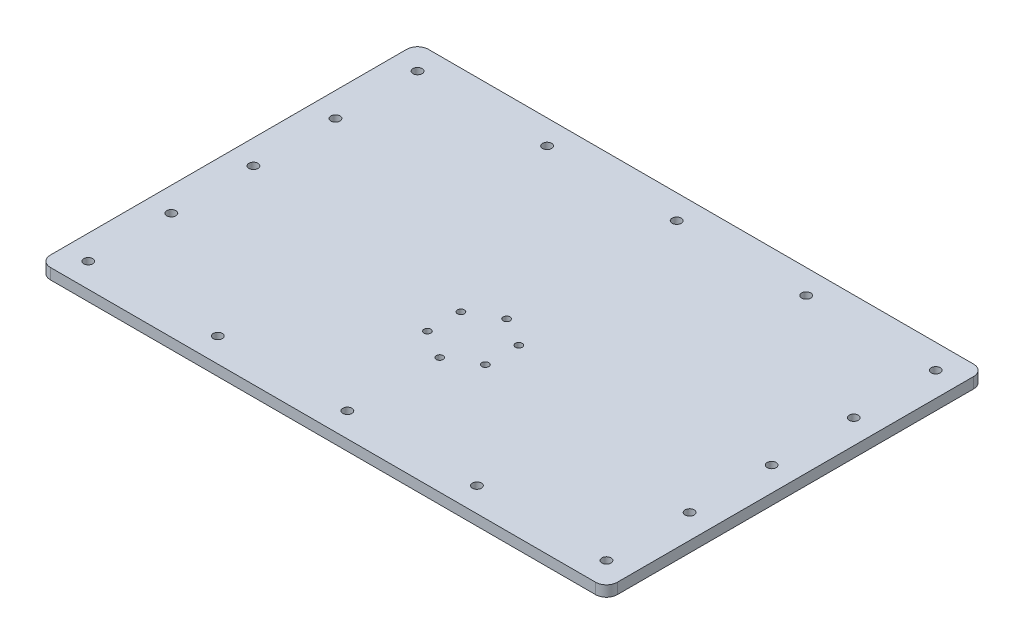
ISO-10303-21;
HEADER;
FILE_DESCRIPTION(('STEP AP214'),'2;1');
FILE_NAME('part.step','',(''),(''),'','','');
FILE_SCHEMA(('AUTOMOTIVE_DESIGN { 1 0 10303 214 1 1 1 1 }'));
ENDSEC;
DATA;
#1=APPLICATION_CONTEXT('core data for automotive mechanical design processes');
#2=APPLICATION_PROTOCOL_DEFINITION('international standard','automotive_design',2000,#1);
#3=PRODUCT_CONTEXT('',#1,'mechanical');
#4=PRODUCT('Part','Part','',(#3));
#5=PRODUCT_RELATED_PRODUCT_CATEGORY('part','',(#4));
#6=PRODUCT_DEFINITION_FORMATION('','',#4);
#7=PRODUCT_DEFINITION_CONTEXT('part definition',#1,'design');
#8=PRODUCT_DEFINITION('design','',#6,#7);
#9=PRODUCT_DEFINITION_SHAPE('','',#8);
#10=(LENGTH_UNIT() NAMED_UNIT(*) SI_UNIT(.MILLI.,.METRE.));
#11=(NAMED_UNIT(*) PLANE_ANGLE_UNIT() SI_UNIT($,.RADIAN.));
#12=(NAMED_UNIT(*) SI_UNIT($,.STERADIAN.) SOLID_ANGLE_UNIT());
#13=UNCERTAINTY_MEASURE_WITH_UNIT(LENGTH_MEASURE(1.E-05),#10,'distance_accuracy_value','');
#14=(GEOMETRIC_REPRESENTATION_CONTEXT(3) GLOBAL_UNCERTAINTY_ASSIGNED_CONTEXT((#13)) GLOBAL_UNIT_ASSIGNED_CONTEXT((#10,
#11,#12)) REPRESENTATION_CONTEXT('',''));
#15=CARTESIAN_POINT('',(0.,0.,0.));
#16=DIRECTION('',(0.,0.,1.));
#17=DIRECTION('',(1.,0.,0.));
#18=AXIS2_PLACEMENT_3D('',#15,#16,#17);
#19=CARTESIAN_POINT('',(-252.5,10.,165.));
#20=DIRECTION('',(0.,-1.,0.));
#21=DIRECTION('',(0.,0.,-1.));
#22=AXIS2_PLACEMENT_3D('',#19,#20,#21);
#23=PLANE('',#22);
#24=CARTESIAN_POINT('',(-252.5,10.,165.));
#25=DIRECTION('',(0.,1.,0.));
#26=DIRECTION('',(0.,0.,-1.));
#27=AXIS2_PLACEMENT_3D('',#24,#25,#26);
#28=CIRCLE('',#27,10.);
#29=CARTESIAN_POINT('',(-262.5,10.,165.));
#30=VERTEX_POINT('',#29);
#31=CARTESIAN_POINT('',(-252.5,10.,175.));
#32=VERTEX_POINT('',#31);
#33=EDGE_CURVE('E154',#30,#32,#28,.T.);
#34=ORIENTED_EDGE('',*,*,#33,.T.);
#35=DIRECTION('',(1.,0.,0.));
#36=VECTOR('',#35,1.);
#37=CARTESIAN_POINT('',(-252.5,10.,175.));
#38=LINE('',#37,#36);
#39=CARTESIAN_POINT('',(252.5,10.,175.));
#40=VERTEX_POINT('',#39);
#41=EDGE_CURVE('E102',#32,#40,#38,.T.);
#42=ORIENTED_EDGE('',*,*,#41,.T.);
#43=CARTESIAN_POINT('',(252.5,10.,165.));
#44=DIRECTION('',(0.,1.,0.));
#45=DIRECTION('',(0.,0.,1.));
#46=AXIS2_PLACEMENT_3D('',#43,#44,#45);
#47=CIRCLE('',#46,10.);
#48=CARTESIAN_POINT('',(262.5,10.,165.));
#49=VERTEX_POINT('',#48);
#50=EDGE_CURVE('E169',#40,#49,#47,.T.);
#51=ORIENTED_EDGE('',*,*,#50,.T.);
#52=DIRECTION('',(0.,0.,-1.));
#53=VECTOR('',#52,1.);
#54=CARTESIAN_POINT('',(262.5,10.,-165.));
#55=LINE('',#54,#53);
#56=CARTESIAN_POINT('',(262.5,10.,-165.));
#57=VERTEX_POINT('',#56);
#58=EDGE_CURVE('E182',#49,#57,#55,.T.);
#59=ORIENTED_EDGE('',*,*,#58,.T.);
#60=CARTESIAN_POINT('',(252.5,10.,-165.));
#61=DIRECTION('',(0.,1.,0.));
#62=DIRECTION('',(0.,0.,1.));
#63=AXIS2_PLACEMENT_3D('',#60,#61,#62);
#64=CIRCLE('',#63,10.);
#65=CARTESIAN_POINT('',(252.5,10.,-175.));
#66=VERTEX_POINT('',#65);
#67=EDGE_CURVE('E121',#57,#66,#64,.T.);
#68=ORIENTED_EDGE('',*,*,#67,.T.);
#69=DIRECTION('',(-1.,0.,0.));
#70=VECTOR('',#69,1.);
#71=CARTESIAN_POINT('',(-252.5,10.,-175.));
#72=LINE('',#71,#70);
#73=CARTESIAN_POINT('',(-252.5,10.,-175.));
#74=VERTEX_POINT('',#73);
#75=EDGE_CURVE('E115',#66,#74,#72,.T.);
#76=ORIENTED_EDGE('',*,*,#75,.T.);
#77=CARTESIAN_POINT('',(-252.5,10.,-165.));
#78=DIRECTION('',(0.,1.,0.));
#79=DIRECTION('',(0.,0.,-1.));
#80=AXIS2_PLACEMENT_3D('',#77,#78,#79);
#81=CIRCLE('',#80,10.);
#82=CARTESIAN_POINT('',(-262.5,10.,-165.));
#83=VERTEX_POINT('',#82);
#84=EDGE_CURVE('E119',#74,#83,#81,.T.);
#85=ORIENTED_EDGE('',*,*,#84,.T.);
#86=DIRECTION('',(0.,0.,1.));
#87=VECTOR('',#86,1.);
#88=CARTESIAN_POINT('',(-262.5,10.,-165.));
#89=LINE('',#88,#87);
#90=EDGE_CURVE('E59',#83,#30,#89,.T.);
#91=ORIENTED_EDGE('',*,*,#90,.T.);
#92=EDGE_LOOP('',(#34,#42,#51,#59,#68,#76,#85,#91));
#93=FACE_BOUND('',#92,.T.);
#94=CARTESIAN_POINT('',(-240.,10.,-152.5));
#95=DIRECTION('',(0.,1.,0.));
#96=DIRECTION('',(0.,0.,1.));
#97=AXIS2_PLACEMENT_3D('',#94,#95,#96);
#98=CIRCLE('',#97,4.20000000000004);
#99=CARTESIAN_POINT('',(-240.,10.,-148.3));
#100=VERTEX_POINT('',#99);
#101=EDGE_CURVE('E143',#100,#100,#98,.T.);
#102=ORIENTED_EDGE('',*,*,#101,.F.);
#103=EDGE_LOOP('',(#102));
#104=FACE_BOUND('',#103,.T.);
#105=CARTESIAN_POINT('',(240.,10.,-152.5));
#106=DIRECTION('',(0.,1.,0.));
#107=DIRECTION('',(0.,0.,1.));
#108=AXIS2_PLACEMENT_3D('',#105,#106,#107);
#109=CIRCLE('',#108,4.19999999999998);
#110=CARTESIAN_POINT('',(240.,10.,-148.3));
#111=VERTEX_POINT('',#110);
#112=EDGE_CURVE('E191',#111,#111,#109,.T.);
#113=ORIENTED_EDGE('',*,*,#112,.F.);
#114=EDGE_LOOP('',(#113));
#115=FACE_BOUND('',#114,.T.);
#116=CARTESIAN_POINT('',(-240.,10.,-76.4999999999999));
#117=DIRECTION('',(0.,1.,0.));
#118=DIRECTION('',(0.,0.,1.));
#119=AXIS2_PLACEMENT_3D('',#116,#117,#118);
#120=CIRCLE('',#119,4.20000000000004);
#121=CARTESIAN_POINT('',(-240.,10.,-72.2999999999999));
#122=VERTEX_POINT('',#121);
#123=EDGE_CURVE('E197',#122,#122,#120,.T.);
#124=ORIENTED_EDGE('',*,*,#123,.F.);
#125=EDGE_LOOP('',(#124));
#126=FACE_BOUND('',#125,.T.);
#127=CARTESIAN_POINT('',(-240.,10.,-0.499999999999945));
#128=DIRECTION('',(0.,1.,0.));
#129=DIRECTION('',(0.,0.,1.));
#130=AXIS2_PLACEMENT_3D('',#127,#128,#129);
#131=CIRCLE('',#130,4.19999999999998);
#132=CARTESIAN_POINT('',(-240.,10.,3.70000000000003));
#133=VERTEX_POINT('',#132);
#134=EDGE_CURVE('E203',#133,#133,#131,.T.);
#135=ORIENTED_EDGE('',*,*,#134,.F.);
#136=EDGE_LOOP('',(#135));
#137=FACE_BOUND('',#136,.T.);
#138=CARTESIAN_POINT('',(-240.,10.,75.5));
#139=DIRECTION('',(0.,1.,0.));
#140=DIRECTION('',(0.,0.,1.));
#141=AXIS2_PLACEMENT_3D('',#138,#139,#140);
#142=CIRCLE('',#141,4.20000000000004);
#143=CARTESIAN_POINT('',(-240.,10.,79.7000000000001));
#144=VERTEX_POINT('',#143);
#145=EDGE_CURVE('E209',#144,#144,#142,.T.);
#146=ORIENTED_EDGE('',*,*,#145,.F.);
#147=EDGE_LOOP('',(#146));
#148=FACE_BOUND('',#147,.T.);
#149=CARTESIAN_POINT('',(-240.,10.,152.5));
#150=DIRECTION('',(0.,1.,0.));
#151=DIRECTION('',(0.,0.,1.));
#152=AXIS2_PLACEMENT_3D('',#149,#150,#151);
#153=CIRCLE('',#152,4.19999999999998);
#154=CARTESIAN_POINT('',(-240.,10.,156.7));
#155=VERTEX_POINT('',#154);
#156=EDGE_CURVE('E215',#155,#155,#153,.T.);
#157=ORIENTED_EDGE('',*,*,#156,.F.);
#158=EDGE_LOOP('',(#157));
#159=FACE_BOUND('',#158,.T.);
#160=CARTESIAN_POINT('',(240.,10.,-76.4999999999999));
#161=DIRECTION('',(0.,1.,0.));
#162=DIRECTION('',(0.,0.,1.));
#163=AXIS2_PLACEMENT_3D('',#160,#161,#162);
#164=CIRCLE('',#163,4.19999999999998);
#165=CARTESIAN_POINT('',(240.,10.,-72.3));
#166=VERTEX_POINT('',#165);
#167=EDGE_CURVE('E221',#166,#166,#164,.T.);
#168=ORIENTED_EDGE('',*,*,#167,.F.);
#169=EDGE_LOOP('',(#168));
#170=FACE_BOUND('',#169,.T.);
#171=CARTESIAN_POINT('',(240.,10.,-0.499999999999945));
#172=DIRECTION('',(0.,1.,0.));
#173=DIRECTION('',(0.,0.,1.));
#174=AXIS2_PLACEMENT_3D('',#171,#172,#173);
#175=CIRCLE('',#174,4.19999999999992);
#176=CARTESIAN_POINT('',(240.,10.,3.69999999999998));
#177=VERTEX_POINT('',#176);
#178=EDGE_CURVE('E227',#177,#177,#175,.T.);
#179=ORIENTED_EDGE('',*,*,#178,.F.);
#180=EDGE_LOOP('',(#179));
#181=FACE_BOUND('',#180,.T.);
#182=CARTESIAN_POINT('',(240.,10.,75.5));
#183=DIRECTION('',(0.,1.,0.));
#184=DIRECTION('',(0.,0.,1.));
#185=AXIS2_PLACEMENT_3D('',#182,#183,#184);
#186=CIRCLE('',#185,4.20000000000004);
#187=CARTESIAN_POINT('',(240.,10.,79.7000000000001));
#188=VERTEX_POINT('',#187);
#189=EDGE_CURVE('E233',#188,#188,#186,.T.);
#190=ORIENTED_EDGE('',*,*,#189,.F.);
#191=EDGE_LOOP('',(#190));
#192=FACE_BOUND('',#191,.T.);
#193=CARTESIAN_POINT('',(-120.,10.,152.5));
#194=DIRECTION('',(0.,1.,0.));
#195=DIRECTION('',(0.,0.,1.));
#196=AXIS2_PLACEMENT_3D('',#193,#194,#195);
#197=CIRCLE('',#196,4.19999999999998);
#198=CARTESIAN_POINT('',(-120.,10.,156.7));
#199=VERTEX_POINT('',#198);
#200=EDGE_CURVE('E239',#199,#199,#197,.T.);
#201=ORIENTED_EDGE('',*,*,#200,.F.);
#202=EDGE_LOOP('',(#201));
#203=FACE_BOUND('',#202,.T.);
#204=CARTESIAN_POINT('',(-120.,10.,-152.5));
#205=DIRECTION('',(0.,1.,0.));
#206=DIRECTION('',(0.,0.,1.));
#207=AXIS2_PLACEMENT_3D('',#204,#205,#206);
#208=CIRCLE('',#207,4.20000000000004);
#209=CARTESIAN_POINT('',(-120.,10.,-148.3));
#210=VERTEX_POINT('',#209);
#211=EDGE_CURVE('E245',#210,#210,#208,.T.);
#212=ORIENTED_EDGE('',*,*,#211,.F.);
#213=EDGE_LOOP('',(#212));
#214=FACE_BOUND('',#213,.T.);
#215=CARTESIAN_POINT('',(0.,10.,5.));
#216=DIRECTION('',(0.,1.,0.));
#217=DIRECTION('',(0.,0.,1.));
#218=AXIS2_PLACEMENT_3D('',#215,#216,#217);
#219=CIRCLE('',#218,3.2);
#220=CARTESIAN_POINT('',(0.,10.,8.20000000000001));
#221=VERTEX_POINT('',#220);
#222=EDGE_CURVE('E251',#221,#221,#219,.T.);
#223=ORIENTED_EDGE('',*,*,#222,.F.);
#224=EDGE_LOOP('',(#223));
#225=FACE_BOUND('',#224,.T.);
#226=CARTESIAN_POINT('',(0.,10.,-152.5));
#227=DIRECTION('',(0.,1.,0.));
#228=DIRECTION('',(0.,0.,1.));
#229=AXIS2_PLACEMENT_3D('',#226,#227,#228);
#230=CIRCLE('',#229,4.20000000000001);
#231=CARTESIAN_POINT('',(0.,10.,-148.3));
#232=VERTEX_POINT('',#231);
#233=EDGE_CURVE('E257',#232,#232,#230,.T.);
#234=ORIENTED_EDGE('',*,*,#233,.F.);
#235=EDGE_LOOP('',(#234));
#236=FACE_BOUND('',#235,.T.);
#237=CARTESIAN_POINT('',(0.,10.,152.5));
#238=DIRECTION('',(0.,1.,0.));
#239=DIRECTION('',(0.,0.,1.));
#240=AXIS2_PLACEMENT_3D('',#237,#238,#239);
#241=CIRCLE('',#240,4.19999999999997);
#242=CARTESIAN_POINT('',(0.,10.,156.7));
#243=VERTEX_POINT('',#242);
#244=EDGE_CURVE('E263',#243,#243,#241,.T.);
#245=ORIENTED_EDGE('',*,*,#244,.F.);
#246=EDGE_LOOP('',(#245));
#247=FACE_BOUND('',#246,.T.);
#248=CARTESIAN_POINT('',(26.8467875173183,10.,20.4999999999989));
#249=DIRECTION('',(0.,1.,0.));
#250=DIRECTION('',(0.,0.,1.));
#251=AXIS2_PLACEMENT_3D('',#248,#249,#250);
#252=CIRCLE('',#251,3.2);
#253=CARTESIAN_POINT('',(26.8467875173183,10.,23.6999999999989));
#254=VERTEX_POINT('',#253);
#255=EDGE_CURVE('E269',#254,#254,#252,.T.);
#256=ORIENTED_EDGE('',*,*,#255,.F.);
#257=EDGE_LOOP('',(#256));
#258=FACE_BOUND('',#257,.T.);
#259=CARTESIAN_POINT('',(26.8467875173195,10.,51.499999999999));
#260=DIRECTION('',(0.,1.,0.));
#261=DIRECTION('',(0.,0.,1.));
#262=AXIS2_PLACEMENT_3D('',#259,#260,#261);
#263=CIRCLE('',#262,3.2);
#264=CARTESIAN_POINT('',(26.8467875173195,10.,54.699999999999));
#265=VERTEX_POINT('',#264);
#266=EDGE_CURVE('E275',#265,#265,#263,.T.);
#267=ORIENTED_EDGE('',*,*,#266,.F.);
#268=EDGE_LOOP('',(#267));
#269=FACE_BOUND('',#268,.T.);
#270=CARTESIAN_POINT('',(2.41156151370987E-12,10.,67.));
#271=DIRECTION('',(0.,1.,0.));
#272=DIRECTION('',(0.,0.,1.));
#273=AXIS2_PLACEMENT_3D('',#270,#271,#272);
#274=CIRCLE('',#273,3.2);
#275=CARTESIAN_POINT('',(2.41156151370987E-12,10.,70.2));
#276=VERTEX_POINT('',#275);
#277=EDGE_CURVE('E281',#276,#276,#274,.T.);
#278=ORIENTED_EDGE('',*,*,#277,.F.);
#279=EDGE_LOOP('',(#278));
#280=FACE_BOUND('',#279,.T.);
#281=CARTESIAN_POINT('',(-26.8467875173158,10.,51.5000000000009));
#282=DIRECTION('',(0.,1.,0.));
#283=DIRECTION('',(0.,0.,1.));
#284=AXIS2_PLACEMENT_3D('',#281,#282,#283);
#285=CIRCLE('',#284,3.2);
#286=CARTESIAN_POINT('',(-26.8467875173158,10.,54.7000000000009));
#287=VERTEX_POINT('',#286);
#288=EDGE_CURVE('E287',#287,#287,#285,.T.);
#289=ORIENTED_EDGE('',*,*,#288,.F.);
#290=EDGE_LOOP('',(#289));
#291=FACE_BOUND('',#290,.T.);
#292=CARTESIAN_POINT('',(120.,10.,-152.5));
#293=DIRECTION('',(0.,1.,0.));
#294=DIRECTION('',(0.,0.,1.));
#295=AXIS2_PLACEMENT_3D('',#292,#293,#294);
#296=CIRCLE('',#295,4.20000000000001);
#297=CARTESIAN_POINT('',(120.,10.,-148.3));
#298=VERTEX_POINT('',#297);
#299=EDGE_CURVE('E293',#298,#298,#296,.T.);
#300=ORIENTED_EDGE('',*,*,#299,.F.);
#301=EDGE_LOOP('',(#300));
#302=FACE_BOUND('',#301,.T.);
#303=CARTESIAN_POINT('',(-26.8467875173168,10.,20.5000000000008));
#304=DIRECTION('',(0.,1.,0.));
#305=DIRECTION('',(0.,0.,1.));
#306=AXIS2_PLACEMENT_3D('',#303,#304,#305);
#307=CIRCLE('',#306,3.2);
#308=CARTESIAN_POINT('',(-26.8467875173168,10.,23.7000000000008));
#309=VERTEX_POINT('',#308);
#310=EDGE_CURVE('E299',#309,#309,#307,.T.);
#311=ORIENTED_EDGE('',*,*,#310,.F.);
#312=EDGE_LOOP('',(#311));
#313=FACE_BOUND('',#312,.T.);
#314=CARTESIAN_POINT('',(120.,10.,152.5));
#315=DIRECTION('',(0.,1.,0.));
#316=DIRECTION('',(0.,0.,1.));
#317=AXIS2_PLACEMENT_3D('',#314,#315,#316);
#318=CIRCLE('',#317,4.19999999999998);
#319=CARTESIAN_POINT('',(120.,10.,156.7));
#320=VERTEX_POINT('',#319);
#321=EDGE_CURVE('E305',#320,#320,#318,.T.);
#322=ORIENTED_EDGE('',*,*,#321,.F.);
#323=EDGE_LOOP('',(#322));
#324=FACE_BOUND('',#323,.T.);
#325=CARTESIAN_POINT('',(240.,10.,152.5));
#326=DIRECTION('',(0.,1.,0.));
#327=DIRECTION('',(0.,0.,1.));
#328=AXIS2_PLACEMENT_3D('',#325,#326,#327);
#329=CIRCLE('',#328,4.19999999999998);
#330=CARTESIAN_POINT('',(240.,10.,156.7));
#331=VERTEX_POINT('',#330);
#332=EDGE_CURVE('E311',#331,#331,#329,.T.);
#333=ORIENTED_EDGE('',*,*,#332,.F.);
#334=EDGE_LOOP('',(#333));
#335=FACE_BOUND('',#334,.T.);
#336=ADVANCED_FACE('F42',(#93,#104,#115,#126,#137,#148,#159,#170,#181,#192,#203,#214,#225,#236,
#247,#258,#269,#280,#291,#302,#313,#324,#335),#23,.F.);
#337=CARTESIAN_POINT('',(-252.5,0.,165.));
#338=DIRECTION('',(0.,-1.,0.));
#339=DIRECTION('',(0.,0.,-1.));
#340=AXIS2_PLACEMENT_3D('',#337,#338,#339);
#341=PLANE('',#340);
#342=CARTESIAN_POINT('',(120.,0.,152.5));
#343=DIRECTION('',(0.,1.,0.));
#344=DIRECTION('',(0.,0.,1.));
#345=AXIS2_PLACEMENT_3D('',#342,#343,#344);
#346=CIRCLE('',#345,4.19999999999998);
#347=CARTESIAN_POINT('',(120.,0.,156.7));
#348=VERTEX_POINT('',#347);
#349=EDGE_CURVE('E308',#348,#348,#346,.T.);
#350=ORIENTED_EDGE('',*,*,#349,.T.);
#351=EDGE_LOOP('',(#350));
#352=FACE_BOUND('',#351,.T.);
#353=CARTESIAN_POINT('',(120.,0.,-152.5));
#354=DIRECTION('',(0.,1.,0.));
#355=DIRECTION('',(0.,0.,1.));
#356=AXIS2_PLACEMENT_3D('',#353,#354,#355);
#357=CIRCLE('',#356,4.20000000000001);
#358=CARTESIAN_POINT('',(120.,0.,-148.3));
#359=VERTEX_POINT('',#358);
#360=EDGE_CURVE('E296',#359,#359,#357,.T.);
#361=ORIENTED_EDGE('',*,*,#360,.T.);
#362=EDGE_LOOP('',(#361));
#363=FACE_BOUND('',#362,.T.);
#364=CARTESIAN_POINT('',(2.41156151370987E-12,0.,67.));
#365=DIRECTION('',(0.,1.,0.));
#366=DIRECTION('',(0.,0.,1.));
#367=AXIS2_PLACEMENT_3D('',#364,#365,#366);
#368=CIRCLE('',#367,3.2);
#369=CARTESIAN_POINT('',(2.41156151370987E-12,0.,70.2));
#370=VERTEX_POINT('',#369);
#371=EDGE_CURVE('E284',#370,#370,#368,.T.);
#372=ORIENTED_EDGE('',*,*,#371,.T.);
#373=EDGE_LOOP('',(#372));
#374=FACE_BOUND('',#373,.T.);
#375=CARTESIAN_POINT('',(26.8467875173183,0.,20.4999999999989));
#376=DIRECTION('',(0.,1.,0.));
#377=DIRECTION('',(0.,0.,1.));
#378=AXIS2_PLACEMENT_3D('',#375,#376,#377);
#379=CIRCLE('',#378,3.2);
#380=CARTESIAN_POINT('',(26.8467875173183,0.,23.6999999999989));
#381=VERTEX_POINT('',#380);
#382=EDGE_CURVE('E272',#381,#381,#379,.T.);
#383=ORIENTED_EDGE('',*,*,#382,.T.);
#384=EDGE_LOOP('',(#383));
#385=FACE_BOUND('',#384,.T.);
#386=CARTESIAN_POINT('',(0.,0.,-152.5));
#387=DIRECTION('',(0.,1.,0.));
#388=DIRECTION('',(0.,0.,1.));
#389=AXIS2_PLACEMENT_3D('',#386,#387,#388);
#390=CIRCLE('',#389,4.20000000000001);
#391=CARTESIAN_POINT('',(0.,0.,-148.3));
#392=VERTEX_POINT('',#391);
#393=EDGE_CURVE('E260',#392,#392,#390,.T.);
#394=ORIENTED_EDGE('',*,*,#393,.T.);
#395=EDGE_LOOP('',(#394));
#396=FACE_BOUND('',#395,.T.);
#397=CARTESIAN_POINT('',(-120.,0.,-152.5));
#398=DIRECTION('',(0.,1.,0.));
#399=DIRECTION('',(0.,0.,1.));
#400=AXIS2_PLACEMENT_3D('',#397,#398,#399);
#401=CIRCLE('',#400,4.20000000000004);
#402=CARTESIAN_POINT('',(-120.,0.,-148.3));
#403=VERTEX_POINT('',#402);
#404=EDGE_CURVE('E248',#403,#403,#401,.T.);
#405=ORIENTED_EDGE('',*,*,#404,.T.);
#406=EDGE_LOOP('',(#405));
#407=FACE_BOUND('',#406,.T.);
#408=CARTESIAN_POINT('',(240.,0.,75.5));
#409=DIRECTION('',(0.,1.,0.));
#410=DIRECTION('',(0.,0.,1.));
#411=AXIS2_PLACEMENT_3D('',#408,#409,#410);
#412=CIRCLE('',#411,4.20000000000004);
#413=CARTESIAN_POINT('',(240.,0.,79.7000000000001));
#414=VERTEX_POINT('',#413);
#415=EDGE_CURVE('E236',#414,#414,#412,.T.);
#416=ORIENTED_EDGE('',*,*,#415,.T.);
#417=EDGE_LOOP('',(#416));
#418=FACE_BOUND('',#417,.T.);
#419=CARTESIAN_POINT('',(240.,0.,-76.4999999999999));
#420=DIRECTION('',(0.,1.,0.));
#421=DIRECTION('',(0.,0.,1.));
#422=AXIS2_PLACEMENT_3D('',#419,#420,#421);
#423=CIRCLE('',#422,4.19999999999998);
#424=CARTESIAN_POINT('',(240.,0.,-72.3));
#425=VERTEX_POINT('',#424);
#426=EDGE_CURVE('E224',#425,#425,#423,.T.);
#427=ORIENTED_EDGE('',*,*,#426,.T.);
#428=EDGE_LOOP('',(#427));
#429=FACE_BOUND('',#428,.T.);
#430=CARTESIAN_POINT('',(-240.,0.,75.5));
#431=DIRECTION('',(0.,1.,0.));
#432=DIRECTION('',(0.,0.,1.));
#433=AXIS2_PLACEMENT_3D('',#430,#431,#432);
#434=CIRCLE('',#433,4.20000000000004);
#435=CARTESIAN_POINT('',(-240.,0.,79.7000000000001));
#436=VERTEX_POINT('',#435);
#437=EDGE_CURVE('E212',#436,#436,#434,.T.);
#438=ORIENTED_EDGE('',*,*,#437,.T.);
#439=EDGE_LOOP('',(#438));
#440=FACE_BOUND('',#439,.T.);
#441=CARTESIAN_POINT('',(-240.,0.,-76.4999999999999));
#442=DIRECTION('',(0.,1.,0.));
#443=DIRECTION('',(0.,0.,1.));
#444=AXIS2_PLACEMENT_3D('',#441,#442,#443);
#445=CIRCLE('',#444,4.20000000000004);
#446=CARTESIAN_POINT('',(-240.,0.,-72.2999999999999));
#447=VERTEX_POINT('',#446);
#448=EDGE_CURVE('E200',#447,#447,#445,.T.);
#449=ORIENTED_EDGE('',*,*,#448,.T.);
#450=EDGE_LOOP('',(#449));
#451=FACE_BOUND('',#450,.T.);
#452=CARTESIAN_POINT('',(-240.,0.,-152.5));
#453=DIRECTION('',(0.,1.,0.));
#454=DIRECTION('',(0.,0.,1.));
#455=AXIS2_PLACEMENT_3D('',#452,#453,#454);
#456=CIRCLE('',#455,4.20000000000004);
#457=CARTESIAN_POINT('',(-240.,0.,-148.3));
#458=VERTEX_POINT('',#457);
#459=EDGE_CURVE('E188',#458,#458,#456,.T.);
#460=ORIENTED_EDGE('',*,*,#459,.T.);
#461=EDGE_LOOP('',(#460));
#462=FACE_BOUND('',#461,.T.);
#463=CARTESIAN_POINT('',(-252.5,0.,165.));
#464=DIRECTION('',(0.,1.,0.));
#465=DIRECTION('',(0.,0.,-1.));
#466=AXIS2_PLACEMENT_3D('',#463,#464,#465);
#467=CIRCLE('',#466,10.);
#468=CARTESIAN_POINT('',(-262.5,0.,165.));
#469=VERTEX_POINT('',#468);
#470=CARTESIAN_POINT('',(-252.5,0.,175.));
#471=VERTEX_POINT('',#470);
#472=EDGE_CURVE('E139',#469,#471,#467,.T.);
#473=ORIENTED_EDGE('',*,*,#472,.F.);
#474=DIRECTION('',(0.,0.,1.));
#475=VECTOR('',#474,1.);
#476=CARTESIAN_POINT('',(-262.5,0.,-165.));
#477=LINE('',#476,#475);
#478=CARTESIAN_POINT('',(-262.5,0.,-165.));
#479=VERTEX_POINT('',#478);
#480=EDGE_CURVE('E94',#479,#469,#477,.T.);
#481=ORIENTED_EDGE('',*,*,#480,.F.);
#482=CARTESIAN_POINT('',(-252.5,0.,-165.));
#483=DIRECTION('',(0.,1.,0.));
#484=DIRECTION('',(0.,0.,-1.));
#485=AXIS2_PLACEMENT_3D('',#482,#483,#484);
#486=CIRCLE('',#485,10.);
#487=CARTESIAN_POINT('',(-252.5,0.,-175.));
#488=VERTEX_POINT('',#487);
#489=EDGE_CURVE('E88',#488,#479,#486,.T.);
#490=ORIENTED_EDGE('',*,*,#489,.F.);
#491=DIRECTION('',(-1.,0.,0.));
#492=VECTOR('',#491,1.);
#493=CARTESIAN_POINT('',(-252.5,0.,-175.));
#494=LINE('',#493,#492);
#495=CARTESIAN_POINT('',(252.5,0.,-175.));
#496=VERTEX_POINT('',#495);
#497=EDGE_CURVE('E129',#496,#488,#494,.T.);
#498=ORIENTED_EDGE('',*,*,#497,.F.);
#499=CARTESIAN_POINT('',(252.5,0.,-165.));
#500=DIRECTION('',(0.,1.,0.));
#501=DIRECTION('',(0.,0.,1.));
#502=AXIS2_PLACEMENT_3D('',#499,#500,#501);
#503=CIRCLE('',#502,10.);
#504=CARTESIAN_POINT('',(262.5,0.,-165.));
#505=VERTEX_POINT('',#504);
#506=EDGE_CURVE('E149',#505,#496,#503,.T.);
#507=ORIENTED_EDGE('',*,*,#506,.F.);
#508=DIRECTION('',(0.,0.,-1.));
#509=VECTOR('',#508,1.);
#510=CARTESIAN_POINT('',(262.5,0.,-165.));
#511=LINE('',#510,#509);
#512=CARTESIAN_POINT('',(262.5,0.,165.));
#513=VERTEX_POINT('',#512);
#514=EDGE_CURVE('E147',#513,#505,#511,.T.);
#515=ORIENTED_EDGE('',*,*,#514,.F.);
#516=CARTESIAN_POINT('',(252.5,0.,165.));
#517=DIRECTION('',(0.,1.,0.));
#518=DIRECTION('',(0.,0.,1.));
#519=AXIS2_PLACEMENT_3D('',#516,#517,#518);
#520=CIRCLE('',#519,10.);
#521=CARTESIAN_POINT('',(252.5,0.,175.));
#522=VERTEX_POINT('',#521);
#523=EDGE_CURVE('E145',#522,#513,#520,.T.);
#524=ORIENTED_EDGE('',*,*,#523,.F.);
#525=DIRECTION('',(1.,0.,0.));
#526=VECTOR('',#525,1.);
#527=CARTESIAN_POINT('',(-252.5,0.,175.));
#528=LINE('',#527,#526);
#529=EDGE_CURVE('E142',#471,#522,#528,.T.);
#530=ORIENTED_EDGE('',*,*,#529,.F.);
#531=EDGE_LOOP('',(#473,#481,#490,#498,#507,#515,#524,#530));
#532=FACE_BOUND('',#531,.T.);
#533=CARTESIAN_POINT('',(240.,0.,-152.5));
#534=DIRECTION('',(0.,1.,0.));
#535=DIRECTION('',(0.,0.,1.));
#536=AXIS2_PLACEMENT_3D('',#533,#534,#535);
#537=CIRCLE('',#536,4.19999999999998);
#538=CARTESIAN_POINT('',(240.,0.,-148.3));
#539=VERTEX_POINT('',#538);
#540=EDGE_CURVE('E194',#539,#539,#537,.T.);
#541=ORIENTED_EDGE('',*,*,#540,.T.);
#542=EDGE_LOOP('',(#541));
#543=FACE_BOUND('',#542,.T.);
#544=CARTESIAN_POINT('',(-240.,0.,-0.499999999999945));
#545=DIRECTION('',(0.,1.,0.));
#546=DIRECTION('',(0.,0.,1.));
#547=AXIS2_PLACEMENT_3D('',#544,#545,#546);
#548=CIRCLE('',#547,4.19999999999998);
#549=CARTESIAN_POINT('',(-240.,0.,3.70000000000003));
#550=VERTEX_POINT('',#549);
#551=EDGE_CURVE('E206',#550,#550,#548,.T.);
#552=ORIENTED_EDGE('',*,*,#551,.T.);
#553=EDGE_LOOP('',(#552));
#554=FACE_BOUND('',#553,.T.);
#555=CARTESIAN_POINT('',(-240.,0.,152.5));
#556=DIRECTION('',(0.,1.,0.));
#557=DIRECTION('',(0.,0.,1.));
#558=AXIS2_PLACEMENT_3D('',#555,#556,#557);
#559=CIRCLE('',#558,4.19999999999998);
#560=CARTESIAN_POINT('',(-240.,0.,156.7));
#561=VERTEX_POINT('',#560);
#562=EDGE_CURVE('E218',#561,#561,#559,.T.);
#563=ORIENTED_EDGE('',*,*,#562,.T.);
#564=EDGE_LOOP('',(#563));
#565=FACE_BOUND('',#564,.T.);
#566=CARTESIAN_POINT('',(240.,0.,-0.499999999999945));
#567=DIRECTION('',(0.,1.,0.));
#568=DIRECTION('',(0.,0.,1.));
#569=AXIS2_PLACEMENT_3D('',#566,#567,#568);
#570=CIRCLE('',#569,4.19999999999992);
#571=CARTESIAN_POINT('',(240.,0.,3.69999999999998));
#572=VERTEX_POINT('',#571);
#573=EDGE_CURVE('E230',#572,#572,#570,.T.);
#574=ORIENTED_EDGE('',*,*,#573,.T.);
#575=EDGE_LOOP('',(#574));
#576=FACE_BOUND('',#575,.T.);
#577=CARTESIAN_POINT('',(-120.,0.,152.5));
#578=DIRECTION('',(0.,1.,0.));
#579=DIRECTION('',(0.,0.,1.));
#580=AXIS2_PLACEMENT_3D('',#577,#578,#579);
#581=CIRCLE('',#580,4.19999999999998);
#582=CARTESIAN_POINT('',(-120.,0.,156.7));
#583=VERTEX_POINT('',#582);
#584=EDGE_CURVE('E242',#583,#583,#581,.T.);
#585=ORIENTED_EDGE('',*,*,#584,.T.);
#586=EDGE_LOOP('',(#585));
#587=FACE_BOUND('',#586,.T.);
#588=CARTESIAN_POINT('',(0.,0.,5.));
#589=DIRECTION('',(0.,1.,0.));
#590=DIRECTION('',(0.,0.,1.));
#591=AXIS2_PLACEMENT_3D('',#588,#589,#590);
#592=CIRCLE('',#591,3.2);
#593=CARTESIAN_POINT('',(0.,0.,8.20000000000001));
#594=VERTEX_POINT('',#593);
#595=EDGE_CURVE('E254',#594,#594,#592,.T.);
#596=ORIENTED_EDGE('',*,*,#595,.T.);
#597=EDGE_LOOP('',(#596));
#598=FACE_BOUND('',#597,.T.);
#599=CARTESIAN_POINT('',(0.,0.,152.5));
#600=DIRECTION('',(0.,1.,0.));
#601=DIRECTION('',(0.,0.,1.));
#602=AXIS2_PLACEMENT_3D('',#599,#600,#601);
#603=CIRCLE('',#602,4.19999999999997);
#604=CARTESIAN_POINT('',(0.,0.,156.7));
#605=VERTEX_POINT('',#604);
#606=EDGE_CURVE('E266',#605,#605,#603,.T.);
#607=ORIENTED_EDGE('',*,*,#606,.T.);
#608=EDGE_LOOP('',(#607));
#609=FACE_BOUND('',#608,.T.);
#610=CARTESIAN_POINT('',(26.8467875173195,0.,51.499999999999));
#611=DIRECTION('',(0.,1.,0.));
#612=DIRECTION('',(0.,0.,1.));
#613=AXIS2_PLACEMENT_3D('',#610,#611,#612);
#614=CIRCLE('',#613,3.2);
#615=CARTESIAN_POINT('',(26.8467875173195,0.,54.699999999999));
#616=VERTEX_POINT('',#615);
#617=EDGE_CURVE('E278',#616,#616,#614,.T.);
#618=ORIENTED_EDGE('',*,*,#617,.T.);
#619=EDGE_LOOP('',(#618));
#620=FACE_BOUND('',#619,.T.);
#621=CARTESIAN_POINT('',(-26.8467875173158,0.,51.5000000000009));
#622=DIRECTION('',(0.,1.,0.));
#623=DIRECTION('',(0.,0.,1.));
#624=AXIS2_PLACEMENT_3D('',#621,#622,#623);
#625=CIRCLE('',#624,3.2);
#626=CARTESIAN_POINT('',(-26.8467875173158,0.,54.7000000000009));
#627=VERTEX_POINT('',#626);
#628=EDGE_CURVE('E290',#627,#627,#625,.T.);
#629=ORIENTED_EDGE('',*,*,#628,.T.);
#630=EDGE_LOOP('',(#629));
#631=FACE_BOUND('',#630,.T.);
#632=CARTESIAN_POINT('',(-26.8467875173168,0.,20.5000000000008));
#633=DIRECTION('',(0.,1.,0.));
#634=DIRECTION('',(0.,0.,1.));
#635=AXIS2_PLACEMENT_3D('',#632,#633,#634);
#636=CIRCLE('',#635,3.2);
#637=CARTESIAN_POINT('',(-26.8467875173168,0.,23.7000000000008));
#638=VERTEX_POINT('',#637);
#639=EDGE_CURVE('E302',#638,#638,#636,.T.);
#640=ORIENTED_EDGE('',*,*,#639,.T.);
#641=EDGE_LOOP('',(#640));
#642=FACE_BOUND('',#641,.T.);
#643=CARTESIAN_POINT('',(240.,0.,152.5));
#644=DIRECTION('',(0.,1.,0.));
#645=DIRECTION('',(0.,0.,1.));
#646=AXIS2_PLACEMENT_3D('',#643,#644,#645);
#647=CIRCLE('',#646,4.19999999999998);
#648=CARTESIAN_POINT('',(240.,0.,156.7));
#649=VERTEX_POINT('',#648);
#650=EDGE_CURVE('E314',#649,#649,#647,.T.);
#651=ORIENTED_EDGE('',*,*,#650,.T.);
#652=EDGE_LOOP('',(#651));
#653=FACE_BOUND('',#652,.T.);
#654=ADVANCED_FACE('F173',(#352,#363,#374,#385,#396,#407,#418,#429,#440,#451,#462,#532,#543,
#554,#565,#576,#587,#598,#609,#620,#631,#642,#653),#341,.T.);
#655=CARTESIAN_POINT('',(-252.5,10.,165.));
#656=DIRECTION('',(0.,-1.,0.));
#657=DIRECTION('',(0.,0.,-1.));
#658=AXIS2_PLACEMENT_3D('',#655,#656,#657);
#659=CYLINDRICAL_SURFACE('',#658,10.);
#660=ORIENTED_EDGE('',*,*,#472,.T.);
#661=DIRECTION('',(0.,-1.,0.));
#662=VECTOR('',#661,1.);
#663=CARTESIAN_POINT('',(-252.5,10.,175.));
#664=LINE('',#663,#662);
#665=EDGE_CURVE('E11',#32,#471,#664,.T.);
#666=ORIENTED_EDGE('',*,*,#665,.F.);
#667=ORIENTED_EDGE('',*,*,#33,.F.);
#668=DIRECTION('',(0.,-1.,0.));
#669=VECTOR('',#668,1.);
#670=CARTESIAN_POINT('',(-262.5,10.,165.));
#671=LINE('',#670,#669);
#672=EDGE_CURVE('E135',#30,#469,#671,.T.);
#673=ORIENTED_EDGE('',*,*,#672,.T.);
#674=EDGE_LOOP('',(#660,#666,#667,#673));
#675=FACE_BOUND('',#674,.T.);
#676=ADVANCED_FACE('F44',(#675),#659,.T.);
#677=CARTESIAN_POINT('',(-252.5,10.,175.));
#678=DIRECTION('',(0.,0.,-1.));
#679=DIRECTION('',(-1.,0.,0.));
#680=AXIS2_PLACEMENT_3D('',#677,#678,#679);
#681=PLANE('',#680);
#682=ORIENTED_EDGE('',*,*,#529,.T.);
#683=DIRECTION('',(0.,-1.,0.));
#684=VECTOR('',#683,1.);
#685=CARTESIAN_POINT('',(252.5,10.,175.));
#686=LINE('',#685,#684);
#687=EDGE_CURVE('E51',#40,#522,#686,.T.);
#688=ORIENTED_EDGE('',*,*,#687,.F.);
#689=ORIENTED_EDGE('',*,*,#41,.F.);
#690=ORIENTED_EDGE('',*,*,#665,.T.);
#691=EDGE_LOOP('',(#682,#688,#689,#690));
#692=FACE_BOUND('',#691,.T.);
#693=ADVANCED_FACE('F346',(#692),#681,.F.);
#694=CARTESIAN_POINT('',(252.5,10.,165.));
#695=DIRECTION('',(0.,-1.,0.));
#696=DIRECTION('',(0.,0.,-1.));
#697=AXIS2_PLACEMENT_3D('',#694,#695,#696);
#698=CYLINDRICAL_SURFACE('',#697,10.);
#699=ORIENTED_EDGE('',*,*,#523,.T.);
#700=DIRECTION('',(0.,-1.,0.));
#701=VECTOR('',#700,1.);
#702=CARTESIAN_POINT('',(262.5,10.,165.));
#703=LINE('',#702,#701);
#704=EDGE_CURVE('E161',#49,#513,#703,.T.);
#705=ORIENTED_EDGE('',*,*,#704,.F.);
#706=ORIENTED_EDGE('',*,*,#50,.F.);
#707=ORIENTED_EDGE('',*,*,#687,.T.);
#708=EDGE_LOOP('',(#699,#705,#706,#707));
#709=FACE_BOUND('',#708,.T.);
#710=ADVANCED_FACE('F167',(#709),#698,.T.);
#711=CARTESIAN_POINT('',(262.5,10.,-165.));
#712=DIRECTION('',(-1.,0.,0.));
#713=DIRECTION('',(0.,0.,1.));
#714=AXIS2_PLACEMENT_3D('',#711,#712,#713);
#715=PLANE('',#714);
#716=ORIENTED_EDGE('',*,*,#514,.T.);
#717=DIRECTION('',(0.,-1.,0.));
#718=VECTOR('',#717,1.);
#719=CARTESIAN_POINT('',(262.5,10.,-165.));
#720=LINE('',#719,#718);
#721=EDGE_CURVE('E158',#57,#505,#720,.T.);
#722=ORIENTED_EDGE('',*,*,#721,.F.);
#723=ORIENTED_EDGE('',*,*,#58,.F.);
#724=ORIENTED_EDGE('',*,*,#704,.T.);
#725=EDGE_LOOP('',(#716,#722,#723,#724));
#726=FACE_BOUND('',#725,.T.);
#727=ADVANCED_FACE('F178',(#726),#715,.F.);
#728=CARTESIAN_POINT('',(252.5,10.,-165.));
#729=DIRECTION('',(0.,-1.,0.));
#730=DIRECTION('',(0.,0.,-1.));
#731=AXIS2_PLACEMENT_3D('',#728,#729,#730);
#732=CYLINDRICAL_SURFACE('',#731,10.);
#733=ORIENTED_EDGE('',*,*,#506,.T.);
#734=DIRECTION('',(0.,-1.,0.));
#735=VECTOR('',#734,1.);
#736=CARTESIAN_POINT('',(252.5,10.,-175.));
#737=LINE('',#736,#735);
#738=EDGE_CURVE('E130',#66,#496,#737,.T.);
#739=ORIENTED_EDGE('',*,*,#738,.F.);
#740=ORIENTED_EDGE('',*,*,#67,.F.);
#741=ORIENTED_EDGE('',*,*,#721,.T.);
#742=EDGE_LOOP('',(#733,#739,#740,#741));
#743=FACE_BOUND('',#742,.T.);
#744=ADVANCED_FACE('F181',(#743),#732,.T.);
#745=CARTESIAN_POINT('',(-252.5,10.,-175.));
#746=DIRECTION('',(0.,0.,1.));
#747=DIRECTION('',(1.,0.,0.));
#748=AXIS2_PLACEMENT_3D('',#745,#746,#747);
#749=PLANE('',#748);
#750=ORIENTED_EDGE('',*,*,#497,.T.);
#751=DIRECTION('',(0.,-1.,0.));
#752=VECTOR('',#751,1.);
#753=CARTESIAN_POINT('',(-252.5,10.,-175.));
#754=LINE('',#753,#752);
#755=EDGE_CURVE('E126',#74,#488,#754,.T.);
#756=ORIENTED_EDGE('',*,*,#755,.F.);
#757=ORIENTED_EDGE('',*,*,#75,.F.);
#758=ORIENTED_EDGE('',*,*,#738,.T.);
#759=EDGE_LOOP('',(#750,#756,#757,#758));
#760=FACE_BOUND('',#759,.T.);
#761=ADVANCED_FACE('F127',(#760),#749,.F.);
#762=CARTESIAN_POINT('',(-252.5,10.,-165.));
#763=DIRECTION('',(0.,-1.,0.));
#764=DIRECTION('',(0.,0.,-1.));
#765=AXIS2_PLACEMENT_3D('',#762,#763,#764);
#766=CYLINDRICAL_SURFACE('',#765,10.);
#767=ORIENTED_EDGE('',*,*,#489,.T.);
#768=DIRECTION('',(0.,-1.,0.));
#769=VECTOR('',#768,1.);
#770=CARTESIAN_POINT('',(-262.5,10.,-165.));
#771=LINE('',#770,#769);
#772=EDGE_CURVE('E131',#83,#479,#771,.T.);
#773=ORIENTED_EDGE('',*,*,#772,.F.);
#774=ORIENTED_EDGE('',*,*,#84,.F.);
#775=ORIENTED_EDGE('',*,*,#755,.T.);
#776=EDGE_LOOP('',(#767,#773,#774,#775));
#777=FACE_BOUND('',#776,.T.);
#778=ADVANCED_FACE('F133',(#777),#766,.T.);
#779=CARTESIAN_POINT('',(-262.5,10.,-165.));
#780=DIRECTION('',(1.,0.,0.));
#781=DIRECTION('',(0.,0.,-1.));
#782=AXIS2_PLACEMENT_3D('',#779,#780,#781);
#783=PLANE('',#782);
#784=ORIENTED_EDGE('',*,*,#480,.T.);
#785=ORIENTED_EDGE('',*,*,#672,.F.);
#786=ORIENTED_EDGE('',*,*,#90,.F.);
#787=ORIENTED_EDGE('',*,*,#772,.T.);
#788=EDGE_LOOP('',(#784,#785,#786,#787));
#789=FACE_BOUND('',#788,.T.);
#790=ADVANCED_FACE('F334',(#789),#783,.F.);
#791=CARTESIAN_POINT('',(-240.,10.,-152.5));
#792=DIRECTION('',(0.,-1.,0.));
#793=DIRECTION('',(0.,0.,-1.));
#794=AXIS2_PLACEMENT_3D('',#791,#792,#793);
#795=CYLINDRICAL_SURFACE('',#794,4.20000000000004);
#796=ORIENTED_EDGE('',*,*,#101,.T.);
#797=EDGE_LOOP('',(#796));
#798=FACE_BOUND('',#797,.T.);
#799=ORIENTED_EDGE('',*,*,#459,.F.);
#800=EDGE_LOOP('',(#799));
#801=FACE_BOUND('',#800,.T.);
#802=ADVANCED_FACE('F331',(#798,#801),#795,.F.);
#803=CARTESIAN_POINT('',(240.,10.,-152.5));
#804=DIRECTION('',(0.,-1.,0.));
#805=DIRECTION('',(0.,0.,-1.));
#806=AXIS2_PLACEMENT_3D('',#803,#804,#805);
#807=CYLINDRICAL_SURFACE('',#806,4.19999999999998);
#808=ORIENTED_EDGE('',*,*,#112,.T.);
#809=EDGE_LOOP('',(#808));
#810=FACE_BOUND('',#809,.T.);
#811=ORIENTED_EDGE('',*,*,#540,.F.);
#812=EDGE_LOOP('',(#811));
#813=FACE_BOUND('',#812,.T.);
#814=ADVANCED_FACE('F415',(#810,#813),#807,.F.);
#815=CARTESIAN_POINT('',(-240.,10.,-76.4999999999999));
#816=DIRECTION('',(0.,-1.,0.));
#817=DIRECTION('',(0.,0.,-1.));
#818=AXIS2_PLACEMENT_3D('',#815,#816,#817);
#819=CYLINDRICAL_SURFACE('',#818,4.20000000000004);
#820=ORIENTED_EDGE('',*,*,#123,.T.);
#821=EDGE_LOOP('',(#820));
#822=FACE_BOUND('',#821,.T.);
#823=ORIENTED_EDGE('',*,*,#448,.F.);
#824=EDGE_LOOP('',(#823));
#825=FACE_BOUND('',#824,.T.);
#826=ADVANCED_FACE('F423',(#822,#825),#819,.F.);
#827=CARTESIAN_POINT('',(-240.,10.,-0.499999999999945));
#828=DIRECTION('',(0.,-1.,0.));
#829=DIRECTION('',(0.,0.,-1.));
#830=AXIS2_PLACEMENT_3D('',#827,#828,#829);
#831=CYLINDRICAL_SURFACE('',#830,4.19999999999998);
#832=ORIENTED_EDGE('',*,*,#134,.T.);
#833=EDGE_LOOP('',(#832));
#834=FACE_BOUND('',#833,.T.);
#835=ORIENTED_EDGE('',*,*,#551,.F.);
#836=EDGE_LOOP('',(#835));
#837=FACE_BOUND('',#836,.T.);
#838=ADVANCED_FACE('F431',(#834,#837),#831,.F.);
#839=CARTESIAN_POINT('',(-240.,10.,75.5));
#840=DIRECTION('',(0.,-1.,0.));
#841=DIRECTION('',(0.,0.,-1.));
#842=AXIS2_PLACEMENT_3D('',#839,#840,#841);
#843=CYLINDRICAL_SURFACE('',#842,4.20000000000004);
#844=ORIENTED_EDGE('',*,*,#145,.T.);
#845=EDGE_LOOP('',(#844));
#846=FACE_BOUND('',#845,.T.);
#847=ORIENTED_EDGE('',*,*,#437,.F.);
#848=EDGE_LOOP('',(#847));
#849=FACE_BOUND('',#848,.T.);
#850=ADVANCED_FACE('F440',(#846,#849),#843,.F.);
#851=CARTESIAN_POINT('',(-240.,10.,152.5));
#852=DIRECTION('',(0.,-1.,0.));
#853=DIRECTION('',(0.,0.,-1.));
#854=AXIS2_PLACEMENT_3D('',#851,#852,#853);
#855=CYLINDRICAL_SURFACE('',#854,4.19999999999998);
#856=ORIENTED_EDGE('',*,*,#156,.T.);
#857=EDGE_LOOP('',(#856));
#858=FACE_BOUND('',#857,.T.);
#859=ORIENTED_EDGE('',*,*,#562,.F.);
#860=EDGE_LOOP('',(#859));
#861=FACE_BOUND('',#860,.T.);
#862=ADVANCED_FACE('F449',(#858,#861),#855,.F.);
#863=CARTESIAN_POINT('',(240.,10.,-76.4999999999999));
#864=DIRECTION('',(0.,-1.,0.));
#865=DIRECTION('',(0.,0.,-1.));
#866=AXIS2_PLACEMENT_3D('',#863,#864,#865);
#867=CYLINDRICAL_SURFACE('',#866,4.19999999999998);
#868=ORIENTED_EDGE('',*,*,#167,.T.);
#869=EDGE_LOOP('',(#868));
#870=FACE_BOUND('',#869,.T.);
#871=ORIENTED_EDGE('',*,*,#426,.F.);
#872=EDGE_LOOP('',(#871));
#873=FACE_BOUND('',#872,.T.);
#874=ADVANCED_FACE('F458',(#870,#873),#867,.F.);
#875=CARTESIAN_POINT('',(240.,10.,-0.499999999999945));
#876=DIRECTION('',(0.,-1.,0.));
#877=DIRECTION('',(0.,0.,-1.));
#878=AXIS2_PLACEMENT_3D('',#875,#876,#877);
#879=CYLINDRICAL_SURFACE('',#878,4.19999999999992);
#880=ORIENTED_EDGE('',*,*,#178,.T.);
#881=EDGE_LOOP('',(#880));
#882=FACE_BOUND('',#881,.T.);
#883=ORIENTED_EDGE('',*,*,#573,.F.);
#884=EDGE_LOOP('',(#883));
#885=FACE_BOUND('',#884,.T.);
#886=ADVANCED_FACE('F467',(#882,#885),#879,.F.);
#887=CARTESIAN_POINT('',(240.,10.,75.5));
#888=DIRECTION('',(0.,-1.,0.));
#889=DIRECTION('',(0.,0.,-1.));
#890=AXIS2_PLACEMENT_3D('',#887,#888,#889);
#891=CYLINDRICAL_SURFACE('',#890,4.20000000000004);
#892=ORIENTED_EDGE('',*,*,#189,.T.);
#893=EDGE_LOOP('',(#892));
#894=FACE_BOUND('',#893,.T.);
#895=ORIENTED_EDGE('',*,*,#415,.F.);
#896=EDGE_LOOP('',(#895));
#897=FACE_BOUND('',#896,.T.);
#898=ADVANCED_FACE('F476',(#894,#897),#891,.F.);
#899=CARTESIAN_POINT('',(-120.,10.,152.5));
#900=DIRECTION('',(0.,-1.,0.));
#901=DIRECTION('',(0.,0.,-1.));
#902=AXIS2_PLACEMENT_3D('',#899,#900,#901);
#903=CYLINDRICAL_SURFACE('',#902,4.19999999999998);
#904=ORIENTED_EDGE('',*,*,#200,.T.);
#905=EDGE_LOOP('',(#904));
#906=FACE_BOUND('',#905,.T.);
#907=ORIENTED_EDGE('',*,*,#584,.F.);
#908=EDGE_LOOP('',(#907));
#909=FACE_BOUND('',#908,.T.);
#910=ADVANCED_FACE('F485',(#906,#909),#903,.F.);
#911=CARTESIAN_POINT('',(-120.,10.,-152.5));
#912=DIRECTION('',(0.,-1.,0.));
#913=DIRECTION('',(0.,0.,-1.));
#914=AXIS2_PLACEMENT_3D('',#911,#912,#913);
#915=CYLINDRICAL_SURFACE('',#914,4.20000000000004);
#916=ORIENTED_EDGE('',*,*,#211,.T.);
#917=EDGE_LOOP('',(#916));
#918=FACE_BOUND('',#917,.T.);
#919=ORIENTED_EDGE('',*,*,#404,.F.);
#920=EDGE_LOOP('',(#919));
#921=FACE_BOUND('',#920,.T.);
#922=ADVANCED_FACE('F494',(#918,#921),#915,.F.);
#923=CARTESIAN_POINT('',(0.,10.,5.));
#924=DIRECTION('',(0.,-1.,0.));
#925=DIRECTION('',(0.,0.,-1.));
#926=AXIS2_PLACEMENT_3D('',#923,#924,#925);
#927=CYLINDRICAL_SURFACE('',#926,3.2);
#928=ORIENTED_EDGE('',*,*,#222,.T.);
#929=EDGE_LOOP('',(#928));
#930=FACE_BOUND('',#929,.T.);
#931=ORIENTED_EDGE('',*,*,#595,.F.);
#932=EDGE_LOOP('',(#931));
#933=FACE_BOUND('',#932,.T.);
#934=ADVANCED_FACE('F503',(#930,#933),#927,.F.);
#935=CARTESIAN_POINT('',(0.,10.,-152.5));
#936=DIRECTION('',(0.,-1.,0.));
#937=DIRECTION('',(0.,0.,-1.));
#938=AXIS2_PLACEMENT_3D('',#935,#936,#937);
#939=CYLINDRICAL_SURFACE('',#938,4.20000000000001);
#940=ORIENTED_EDGE('',*,*,#233,.T.);
#941=EDGE_LOOP('',(#940));
#942=FACE_BOUND('',#941,.T.);
#943=ORIENTED_EDGE('',*,*,#393,.F.);
#944=EDGE_LOOP('',(#943));
#945=FACE_BOUND('',#944,.T.);
#946=ADVANCED_FACE('F512',(#942,#945),#939,.F.);
#947=CARTESIAN_POINT('',(0.,10.,152.5));
#948=DIRECTION('',(0.,-1.,0.));
#949=DIRECTION('',(0.,0.,-1.));
#950=AXIS2_PLACEMENT_3D('',#947,#948,#949);
#951=CYLINDRICAL_SURFACE('',#950,4.19999999999997);
#952=ORIENTED_EDGE('',*,*,#244,.T.);
#953=EDGE_LOOP('',(#952));
#954=FACE_BOUND('',#953,.T.);
#955=ORIENTED_EDGE('',*,*,#606,.F.);
#956=EDGE_LOOP('',(#955));
#957=FACE_BOUND('',#956,.T.);
#958=ADVANCED_FACE('F521',(#954,#957),#951,.F.);
#959=CARTESIAN_POINT('',(26.8467875173183,10.,20.4999999999989));
#960=DIRECTION('',(0.,-1.,0.));
#961=DIRECTION('',(0.,0.,-1.));
#962=AXIS2_PLACEMENT_3D('',#959,#960,#961);
#963=CYLINDRICAL_SURFACE('',#962,3.2);
#964=ORIENTED_EDGE('',*,*,#255,.T.);
#965=EDGE_LOOP('',(#964));
#966=FACE_BOUND('',#965,.T.);
#967=ORIENTED_EDGE('',*,*,#382,.F.);
#968=EDGE_LOOP('',(#967));
#969=FACE_BOUND('',#968,.T.);
#970=ADVANCED_FACE('F530',(#966,#969),#963,.F.);
#971=CARTESIAN_POINT('',(26.8467875173195,10.,51.499999999999));
#972=DIRECTION('',(0.,-1.,0.));
#973=DIRECTION('',(0.,0.,-1.));
#974=AXIS2_PLACEMENT_3D('',#971,#972,#973);
#975=CYLINDRICAL_SURFACE('',#974,3.2);
#976=ORIENTED_EDGE('',*,*,#266,.T.);
#977=EDGE_LOOP('',(#976));
#978=FACE_BOUND('',#977,.T.);
#979=ORIENTED_EDGE('',*,*,#617,.F.);
#980=EDGE_LOOP('',(#979));
#981=FACE_BOUND('',#980,.T.);
#982=ADVANCED_FACE('F539',(#978,#981),#975,.F.);
#983=CARTESIAN_POINT('',(2.41156151370987E-12,10.,67.));
#984=DIRECTION('',(0.,-1.,0.));
#985=DIRECTION('',(0.,0.,-1.));
#986=AXIS2_PLACEMENT_3D('',#983,#984,#985);
#987=CYLINDRICAL_SURFACE('',#986,3.2);
#988=ORIENTED_EDGE('',*,*,#277,.T.);
#989=EDGE_LOOP('',(#988));
#990=FACE_BOUND('',#989,.T.);
#991=ORIENTED_EDGE('',*,*,#371,.F.);
#992=EDGE_LOOP('',(#991));
#993=FACE_BOUND('',#992,.T.);
#994=ADVANCED_FACE('F548',(#990,#993),#987,.F.);
#995=CARTESIAN_POINT('',(-26.8467875173158,10.,51.5000000000009));
#996=DIRECTION('',(0.,-1.,0.));
#997=DIRECTION('',(0.,0.,-1.));
#998=AXIS2_PLACEMENT_3D('',#995,#996,#997);
#999=CYLINDRICAL_SURFACE('',#998,3.2);
#1000=ORIENTED_EDGE('',*,*,#288,.T.);
#1001=EDGE_LOOP('',(#1000));
#1002=FACE_BOUND('',#1001,.T.);
#1003=ORIENTED_EDGE('',*,*,#628,.F.);
#1004=EDGE_LOOP('',(#1003));
#1005=FACE_BOUND('',#1004,.T.);
#1006=ADVANCED_FACE('F557',(#1002,#1005),#999,.F.);
#1007=CARTESIAN_POINT('',(120.,10.,-152.5));
#1008=DIRECTION('',(0.,-1.,0.));
#1009=DIRECTION('',(0.,0.,-1.));
#1010=AXIS2_PLACEMENT_3D('',#1007,#1008,#1009);
#1011=CYLINDRICAL_SURFACE('',#1010,4.20000000000001);
#1012=ORIENTED_EDGE('',*,*,#299,.T.);
#1013=EDGE_LOOP('',(#1012));
#1014=FACE_BOUND('',#1013,.T.);
#1015=ORIENTED_EDGE('',*,*,#360,.F.);
#1016=EDGE_LOOP('',(#1015));
#1017=FACE_BOUND('',#1016,.T.);
#1018=ADVANCED_FACE('F566',(#1014,#1017),#1011,.F.);
#1019=CARTESIAN_POINT('',(-26.8467875173168,10.,20.5000000000008));
#1020=DIRECTION('',(0.,-1.,0.));
#1021=DIRECTION('',(0.,0.,-1.));
#1022=AXIS2_PLACEMENT_3D('',#1019,#1020,#1021);
#1023=CYLINDRICAL_SURFACE('',#1022,3.2);
#1024=ORIENTED_EDGE('',*,*,#310,.T.);
#1025=EDGE_LOOP('',(#1024));
#1026=FACE_BOUND('',#1025,.T.);
#1027=ORIENTED_EDGE('',*,*,#639,.F.);
#1028=EDGE_LOOP('',(#1027));
#1029=FACE_BOUND('',#1028,.T.);
#1030=ADVANCED_FACE('F575',(#1026,#1029),#1023,.F.);
#1031=CARTESIAN_POINT('',(120.,10.,152.5));
#1032=DIRECTION('',(0.,-1.,0.));
#1033=DIRECTION('',(0.,0.,-1.));
#1034=AXIS2_PLACEMENT_3D('',#1031,#1032,#1033);
#1035=CYLINDRICAL_SURFACE('',#1034,4.19999999999998);
#1036=ORIENTED_EDGE('',*,*,#321,.T.);
#1037=EDGE_LOOP('',(#1036));
#1038=FACE_BOUND('',#1037,.T.);
#1039=ORIENTED_EDGE('',*,*,#349,.F.);
#1040=EDGE_LOOP('',(#1039));
#1041=FACE_BOUND('',#1040,.T.);
#1042=ADVANCED_FACE('F584',(#1038,#1041),#1035,.F.);
#1043=CARTESIAN_POINT('',(240.,10.,152.5));
#1044=DIRECTION('',(0.,-1.,0.));
#1045=DIRECTION('',(0.,0.,-1.));
#1046=AXIS2_PLACEMENT_3D('',#1043,#1044,#1045);
#1047=CYLINDRICAL_SURFACE('',#1046,4.19999999999998);
#1048=ORIENTED_EDGE('',*,*,#332,.T.);
#1049=EDGE_LOOP('',(#1048));
#1050=FACE_BOUND('',#1049,.T.);
#1051=ORIENTED_EDGE('',*,*,#650,.F.);
#1052=EDGE_LOOP('',(#1051));
#1053=FACE_BOUND('',#1052,.T.);
#1054=ADVANCED_FACE('F320',(#1050,#1053),#1047,.F.);
#1055=CLOSED_SHELL('',(#336,#654,#676,#693,#710,#727,#744,#761,#778,#790,#802,#814,#826,#838,
#850,#862,#874,#886,#898,#910,#922,#934,#946,#958,#970,#982,#994,#1006,#1018,#1030,#1042,#1054));
#1056=MANIFOLD_SOLID_BREP('B2',#1055);
#1057=ADVANCED_BREP_SHAPE_REPRESENTATION('',(#18,#1056),#14);
#1058=SHAPE_DEFINITION_REPRESENTATION(#9,#1057);
ENDSEC;
END-ISO-10303-21;
